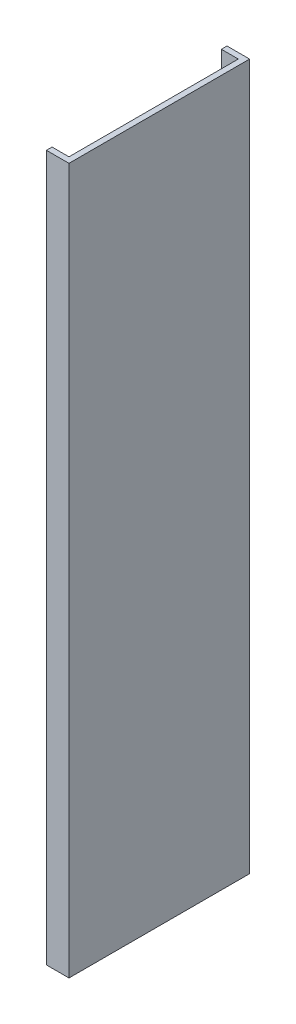
ISO-10303-21;
HEADER;
FILE_DESCRIPTION(('STEP AP214'),'2;1');
FILE_NAME('part.step','',(''),(''),'','','');
FILE_SCHEMA(('AUTOMOTIVE_DESIGN { 1 0 10303 214 1 1 1 1 }'));
ENDSEC;
DATA;
#1=APPLICATION_CONTEXT('core data for automotive mechanical design processes');
#2=APPLICATION_PROTOCOL_DEFINITION('international standard','automotive_design',2000,#1);
#3=PRODUCT_CONTEXT('',#1,'mechanical');
#4=PRODUCT('Part','Part','',(#3));
#5=PRODUCT_RELATED_PRODUCT_CATEGORY('part','',(#4));
#6=PRODUCT_DEFINITION_FORMATION('','',#4);
#7=PRODUCT_DEFINITION_CONTEXT('part definition',#1,'design');
#8=PRODUCT_DEFINITION('design','',#6,#7);
#9=PRODUCT_DEFINITION_SHAPE('','',#8);
#10=(LENGTH_UNIT() NAMED_UNIT(*) SI_UNIT(.MILLI.,.METRE.));
#11=(NAMED_UNIT(*) PLANE_ANGLE_UNIT() SI_UNIT($,.RADIAN.));
#12=(NAMED_UNIT(*) SI_UNIT($,.STERADIAN.) SOLID_ANGLE_UNIT());
#13=UNCERTAINTY_MEASURE_WITH_UNIT(LENGTH_MEASURE(1.E-05),#10,'distance_accuracy_value','');
#14=(GEOMETRIC_REPRESENTATION_CONTEXT(3) GLOBAL_UNCERTAINTY_ASSIGNED_CONTEXT((#13)) GLOBAL_UNIT_ASSIGNED_CONTEXT((#10,
#11,#12)) REPRESENTATION_CONTEXT('',''));
#15=CARTESIAN_POINT('',(0.,0.,0.));
#16=DIRECTION('',(0.,0.,1.));
#17=DIRECTION('',(1.,0.,0.));
#18=AXIS2_PLACEMENT_3D('',#15,#16,#17);
#19=CARTESIAN_POINT('',(0.,625.,75.));
#20=DIRECTION('',(0.,0.,1.));
#21=DIRECTION('',(1.,0.,0.));
#22=AXIS2_PLACEMENT_3D('',#19,#20,#21);
#23=PLANE('',#22);
#24=DIRECTION('',(-1.,0.,0.));
#25=VECTOR('',#24,1.);
#26=CARTESIAN_POINT('',(0.,0.,75.));
#27=LINE('',#26,#25);
#28=CARTESIAN_POINT('',(0.,0.,75.));
#29=VERTEX_POINT('',#28);
#30=CARTESIAN_POINT('',(-15.,0.,75.));
#31=VERTEX_POINT('',#30);
#32=EDGE_CURVE('E129',#29,#31,#27,.T.);
#33=ORIENTED_EDGE('',*,*,#32,.T.);
#34=DIRECTION('',(0.,-1.,0.));
#35=VECTOR('',#34,1.);
#36=CARTESIAN_POINT('',(-15.,625.,75.));
#37=LINE('',#36,#35);
#38=CARTESIAN_POINT('',(-15.,625.,75.));
#39=VERTEX_POINT('',#38);
#40=EDGE_CURVE('E11',#39,#31,#37,.T.);
#41=ORIENTED_EDGE('',*,*,#40,.F.);
#42=DIRECTION('',(-1.,0.,0.));
#43=VECTOR('',#42,1.);
#44=CARTESIAN_POINT('',(0.,625.,75.));
#45=LINE('',#44,#43);
#46=CARTESIAN_POINT('',(0.,625.,75.));
#47=VERTEX_POINT('',#46);
#48=EDGE_CURVE('E87',#47,#39,#45,.T.);
#49=ORIENTED_EDGE('',*,*,#48,.F.);
#50=DIRECTION('',(0.,-1.,0.));
#51=VECTOR('',#50,1.);
#52=CARTESIAN_POINT('',(0.,625.,75.));
#53=LINE('',#52,#51);
#54=EDGE_CURVE('E128',#47,#29,#53,.T.);
#55=ORIENTED_EDGE('',*,*,#54,.T.);
#56=EDGE_LOOP('',(#33,#41,#49,#55));
#57=FACE_BOUND('',#56,.T.);
#58=ADVANCED_FACE('F32',(#57),#23,.F.);
#59=CARTESIAN_POINT('',(-15.,625.,80.));
#60=DIRECTION('',(-1.,0.,0.));
#61=DIRECTION('',(0.,0.,1.));
#62=AXIS2_PLACEMENT_3D('',#59,#60,#61);
#63=PLANE('',#62);
#64=DIRECTION('',(0.,0.,-1.));
#65=VECTOR('',#64,1.);
#66=CARTESIAN_POINT('',(-15.,0.,80.));
#67=LINE('',#66,#65);
#68=CARTESIAN_POINT('',(-15.,0.,80.));
#69=VERTEX_POINT('',#68);
#70=EDGE_CURVE('E132',#69,#31,#67,.T.);
#71=ORIENTED_EDGE('',*,*,#70,.F.);
#72=DIRECTION('',(0.,-1.,0.));
#73=VECTOR('',#72,1.);
#74=CARTESIAN_POINT('',(-15.,625.,80.));
#75=LINE('',#74,#73);
#76=CARTESIAN_POINT('',(-15.,625.,80.));
#77=VERTEX_POINT('',#76);
#78=EDGE_CURVE('E40',#77,#69,#75,.T.);
#79=ORIENTED_EDGE('',*,*,#78,.F.);
#80=DIRECTION('',(0.,0.,-1.));
#81=VECTOR('',#80,1.);
#82=CARTESIAN_POINT('',(-15.,625.,80.));
#83=LINE('',#82,#81);
#84=EDGE_CURVE('E171',#77,#39,#83,.T.);
#85=ORIENTED_EDGE('',*,*,#84,.T.);
#86=ORIENTED_EDGE('',*,*,#40,.T.);
#87=EDGE_LOOP('',(#71,#79,#85,#86));
#88=FACE_BOUND('',#87,.T.);
#89=ADVANCED_FACE('F162',(#88),#63,.T.);
#90=CARTESIAN_POINT('',(0.,625.,80.));
#91=DIRECTION('',(0.,0.,1.));
#92=DIRECTION('',(1.,0.,0.));
#93=AXIS2_PLACEMENT_3D('',#90,#91,#92);
#94=PLANE('',#93);
#95=DIRECTION('',(1.,0.,0.));
#96=VECTOR('',#95,1.);
#97=CARTESIAN_POINT('',(0.,0.,80.));
#98=LINE('',#97,#96);
#99=CARTESIAN_POINT('',(5.00000000000001,0.,80.));
#100=VERTEX_POINT('',#99);
#101=EDGE_CURVE('E135',#100,#69,#98,.F.);
#102=ORIENTED_EDGE('',*,*,#101,.F.);
#103=DIRECTION('',(0.,-1.,0.));
#104=VECTOR('',#103,1.);
#105=CARTESIAN_POINT('',(5.00000000000001,625.,80.));
#106=LINE('',#105,#104);
#107=CARTESIAN_POINT('',(5.00000000000001,625.,80.));
#108=VERTEX_POINT('',#107);
#109=EDGE_CURVE('E152',#108,#100,#106,.T.);
#110=ORIENTED_EDGE('',*,*,#109,.F.);
#111=DIRECTION('',(1.,0.,0.));
#112=VECTOR('',#111,1.);
#113=CARTESIAN_POINT('',(0.,625.,80.));
#114=LINE('',#113,#112);
#115=EDGE_CURVE('E159',#108,#77,#114,.F.);
#116=ORIENTED_EDGE('',*,*,#115,.T.);
#117=ORIENTED_EDGE('',*,*,#78,.T.);
#118=EDGE_LOOP('',(#102,#110,#116,#117));
#119=FACE_BOUND('',#118,.T.);
#120=ADVANCED_FACE('F157',(#119),#94,.T.);
#121=CARTESIAN_POINT('',(5.00000000000001,625.,-75.));
#122=DIRECTION('',(1.,0.,0.));
#123=DIRECTION('',(0.,0.,-1.));
#124=AXIS2_PLACEMENT_3D('',#121,#122,#123);
#125=PLANE('',#124);
#126=DIRECTION('',(0.,0.,-1.));
#127=VECTOR('',#126,1.);
#128=CARTESIAN_POINT('',(5.00000000000001,0.,-75.));
#129=LINE('',#128,#127);
#130=CARTESIAN_POINT('',(5.00000000000001,0.,-80.));
#131=VERTEX_POINT('',#130);
#132=EDGE_CURVE('E138',#131,#100,#129,.F.);
#133=ORIENTED_EDGE('',*,*,#132,.F.);
#134=DIRECTION('',(0.,-1.,0.));
#135=VECTOR('',#134,1.);
#136=CARTESIAN_POINT('',(5.00000000000001,625.,-80.));
#137=LINE('',#136,#135);
#138=CARTESIAN_POINT('',(5.00000000000001,625.,-80.));
#139=VERTEX_POINT('',#138);
#140=EDGE_CURVE('E150',#139,#131,#137,.T.);
#141=ORIENTED_EDGE('',*,*,#140,.F.);
#142=DIRECTION('',(0.,0.,-1.));
#143=VECTOR('',#142,1.);
#144=CARTESIAN_POINT('',(5.00000000000001,625.,-75.));
#145=LINE('',#144,#143);
#146=EDGE_CURVE('E123',#139,#108,#145,.F.);
#147=ORIENTED_EDGE('',*,*,#146,.T.);
#148=ORIENTED_EDGE('',*,*,#109,.T.);
#149=EDGE_LOOP('',(#133,#141,#147,#148));
#150=FACE_BOUND('',#149,.T.);
#151=ADVANCED_FACE('F169',(#150),#125,.T.);
#152=CARTESIAN_POINT('',(-15.,625.,-80.));
#153=DIRECTION('',(0.,0.,-1.));
#154=DIRECTION('',(-1.,0.,0.));
#155=AXIS2_PLACEMENT_3D('',#152,#153,#154);
#156=PLANE('',#155);
#157=DIRECTION('',(1.,0.,0.));
#158=VECTOR('',#157,1.);
#159=CARTESIAN_POINT('',(-15.,0.,-80.));
#160=LINE('',#159,#158);
#161=CARTESIAN_POINT('',(-15.,0.,-80.));
#162=VERTEX_POINT('',#161);
#163=EDGE_CURVE('E141',#162,#131,#160,.T.);
#164=ORIENTED_EDGE('',*,*,#163,.F.);
#165=DIRECTION('',(0.,-1.,0.));
#166=VECTOR('',#165,1.);
#167=CARTESIAN_POINT('',(-15.,625.,-80.));
#168=LINE('',#167,#166);
#169=CARTESIAN_POINT('',(-15.,625.,-80.));
#170=VERTEX_POINT('',#169);
#171=EDGE_CURVE('E111',#170,#162,#168,.T.);
#172=ORIENTED_EDGE('',*,*,#171,.F.);
#173=DIRECTION('',(1.,0.,0.));
#174=VECTOR('',#173,1.);
#175=CARTESIAN_POINT('',(-15.,625.,-80.));
#176=LINE('',#175,#174);
#177=EDGE_CURVE('E121',#170,#139,#176,.T.);
#178=ORIENTED_EDGE('',*,*,#177,.T.);
#179=ORIENTED_EDGE('',*,*,#140,.T.);
#180=EDGE_LOOP('',(#164,#172,#178,#179));
#181=FACE_BOUND('',#180,.T.);
#182=ADVANCED_FACE('F176',(#181),#156,.T.);
#183=CARTESIAN_POINT('',(-15.,625.,-75.));
#184=DIRECTION('',(-1.,0.,0.));
#185=DIRECTION('',(0.,0.,1.));
#186=AXIS2_PLACEMENT_3D('',#183,#184,#185);
#187=PLANE('',#186);
#188=DIRECTION('',(0.,0.,-1.));
#189=VECTOR('',#188,1.);
#190=CARTESIAN_POINT('',(-15.,0.,-75.));
#191=LINE('',#190,#189);
#192=CARTESIAN_POINT('',(-15.,0.,-75.));
#193=VERTEX_POINT('',#192);
#194=EDGE_CURVE('E110',#193,#162,#191,.T.);
#195=ORIENTED_EDGE('',*,*,#194,.F.);
#196=DIRECTION('',(0.,-1.,0.));
#197=VECTOR('',#196,1.);
#198=CARTESIAN_POINT('',(-15.,625.,-75.));
#199=LINE('',#198,#197);
#200=CARTESIAN_POINT('',(-15.,625.,-75.));
#201=VERTEX_POINT('',#200);
#202=EDGE_CURVE('E104',#201,#193,#199,.T.);
#203=ORIENTED_EDGE('',*,*,#202,.F.);
#204=DIRECTION('',(0.,0.,-1.));
#205=VECTOR('',#204,1.);
#206=CARTESIAN_POINT('',(-15.,625.,-75.));
#207=LINE('',#206,#205);
#208=EDGE_CURVE('E108',#201,#170,#207,.T.);
#209=ORIENTED_EDGE('',*,*,#208,.T.);
#210=ORIENTED_EDGE('',*,*,#171,.T.);
#211=EDGE_LOOP('',(#195,#203,#209,#210));
#212=FACE_BOUND('',#211,.T.);
#213=ADVANCED_FACE('F106',(#212),#187,.T.);
#214=CARTESIAN_POINT('',(-15.,625.,-75.));
#215=DIRECTION('',(0.,0.,-1.));
#216=DIRECTION('',(-1.,0.,0.));
#217=AXIS2_PLACEMENT_3D('',#214,#215,#216);
#218=PLANE('',#217);
#219=DIRECTION('',(1.,0.,0.));
#220=VECTOR('',#219,1.);
#221=CARTESIAN_POINT('',(-15.,0.,-75.));
#222=LINE('',#221,#220);
#223=CARTESIAN_POINT('',(0.,0.,-75.));
#224=VERTEX_POINT('',#223);
#225=EDGE_CURVE('E75',#193,#224,#222,.T.);
#226=ORIENTED_EDGE('',*,*,#225,.T.);
#227=DIRECTION('',(0.,-1.,0.));
#228=VECTOR('',#227,1.);
#229=CARTESIAN_POINT('',(0.,625.,-75.));
#230=LINE('',#229,#228);
#231=CARTESIAN_POINT('',(0.,625.,-75.));
#232=VERTEX_POINT('',#231);
#233=EDGE_CURVE('E112',#232,#224,#230,.T.);
#234=ORIENTED_EDGE('',*,*,#233,.F.);
#235=DIRECTION('',(1.,0.,0.));
#236=VECTOR('',#235,1.);
#237=CARTESIAN_POINT('',(-15.,625.,-75.));
#238=LINE('',#237,#236);
#239=EDGE_CURVE('E114',#201,#232,#238,.T.);
#240=ORIENTED_EDGE('',*,*,#239,.F.);
#241=ORIENTED_EDGE('',*,*,#202,.T.);
#242=EDGE_LOOP('',(#226,#234,#240,#241));
#243=FACE_BOUND('',#242,.T.);
#244=ADVANCED_FACE('F115',(#243),#218,.F.);
#245=CARTESIAN_POINT('',(0.,625.,-75.));
#246=DIRECTION('',(1.,0.,0.));
#247=DIRECTION('',(0.,0.,-1.));
#248=AXIS2_PLACEMENT_3D('',#245,#246,#247);
#249=PLANE('',#248);
#250=DIRECTION('',(0.,0.,1.));
#251=VECTOR('',#250,1.);
#252=CARTESIAN_POINT('',(0.,0.,-75.));
#253=LINE('',#252,#251);
#254=EDGE_CURVE('E81',#224,#29,#253,.T.);
#255=ORIENTED_EDGE('',*,*,#254,.T.);
#256=ORIENTED_EDGE('',*,*,#54,.F.);
#257=DIRECTION('',(0.,0.,1.));
#258=VECTOR('',#257,1.);
#259=CARTESIAN_POINT('',(0.,625.,-75.));
#260=LINE('',#259,#258);
#261=EDGE_CURVE('E48',#232,#47,#260,.T.);
#262=ORIENTED_EDGE('',*,*,#261,.F.);
#263=ORIENTED_EDGE('',*,*,#233,.T.);
#264=EDGE_LOOP('',(#255,#256,#262,#263));
#265=FACE_BOUND('',#264,.T.);
#266=ADVANCED_FACE('F178',(#265),#249,.F.);
#267=CARTESIAN_POINT('',(0.,625.,0.));
#268=DIRECTION('',(0.,-1.,0.));
#269=DIRECTION('',(-1.,0.,0.));
#270=AXIS2_PLACEMENT_3D('',#267,#268,#269);
#271=PLANE('',#270);
#272=ORIENTED_EDGE('',*,*,#48,.T.);
#273=ORIENTED_EDGE('',*,*,#84,.F.);
#274=ORIENTED_EDGE('',*,*,#115,.F.);
#275=ORIENTED_EDGE('',*,*,#146,.F.);
#276=ORIENTED_EDGE('',*,*,#177,.F.);
#277=ORIENTED_EDGE('',*,*,#208,.F.);
#278=ORIENTED_EDGE('',*,*,#239,.T.);
#279=ORIENTED_EDGE('',*,*,#261,.T.);
#280=EDGE_LOOP('',(#272,#273,#274,#275,#276,#277,#278,#279));
#281=FACE_BOUND('',#280,.T.);
#282=ADVANCED_FACE('F118',(#281),#271,.F.);
#283=CARTESIAN_POINT('',(0.,0.,0.));
#284=DIRECTION('',(0.,-1.,0.));
#285=DIRECTION('',(-1.,0.,0.));
#286=AXIS2_PLACEMENT_3D('',#283,#284,#285);
#287=PLANE('',#286);
#288=ORIENTED_EDGE('',*,*,#32,.F.);
#289=ORIENTED_EDGE('',*,*,#254,.F.);
#290=ORIENTED_EDGE('',*,*,#225,.F.);
#291=ORIENTED_EDGE('',*,*,#194,.T.);
#292=ORIENTED_EDGE('',*,*,#163,.T.);
#293=ORIENTED_EDGE('',*,*,#132,.T.);
#294=ORIENTED_EDGE('',*,*,#101,.T.);
#295=ORIENTED_EDGE('',*,*,#70,.T.);
#296=EDGE_LOOP('',(#288,#289,#290,#291,#292,#293,#294,#295));
#297=FACE_BOUND('',#296,.T.);
#298=ADVANCED_FACE('F165',(#297),#287,.T.);
#299=CLOSED_SHELL('',(#58,#89,#120,#151,#182,#213,#244,#266,#282,#298));
#300=MANIFOLD_SOLID_BREP('B2',#299);
#301=ADVANCED_BREP_SHAPE_REPRESENTATION('',(#18,#300),#14);
#302=SHAPE_DEFINITION_REPRESENTATION(#9,#301);
ENDSEC;
END-ISO-10303-21;
